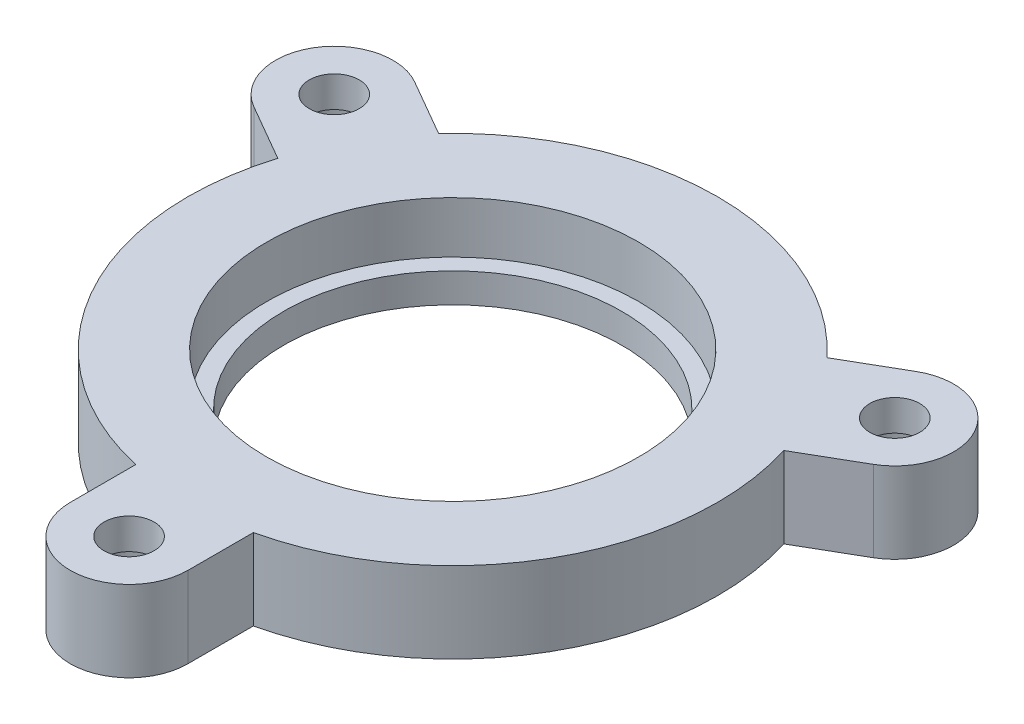
ISO-10303-21;
HEADER;
FILE_DESCRIPTION(('STEP AP214'),'2;1');
FILE_NAME('part.step','',(''),(''),'','','');
FILE_SCHEMA(('AUTOMOTIVE_DESIGN { 1 0 10303 214 1 1 1 1 }'));
ENDSEC;
DATA;
#1=APPLICATION_CONTEXT('core data for automotive mechanical design processes');
#2=APPLICATION_PROTOCOL_DEFINITION('international standard','automotive_design',2000,#1);
#3=PRODUCT_CONTEXT('',#1,'mechanical');
#4=PRODUCT('Part','Part','',(#3));
#5=PRODUCT_RELATED_PRODUCT_CATEGORY('part','',(#4));
#6=PRODUCT_DEFINITION_FORMATION('','',#4);
#7=PRODUCT_DEFINITION_CONTEXT('part definition',#1,'design');
#8=PRODUCT_DEFINITION('design','',#6,#7);
#9=PRODUCT_DEFINITION_SHAPE('','',#8);
#10=(LENGTH_UNIT() NAMED_UNIT(*) SI_UNIT(.MILLI.,.METRE.));
#11=(NAMED_UNIT(*) PLANE_ANGLE_UNIT() SI_UNIT($,.RADIAN.));
#12=(NAMED_UNIT(*) SI_UNIT($,.STERADIAN.) SOLID_ANGLE_UNIT());
#13=UNCERTAINTY_MEASURE_WITH_UNIT(LENGTH_MEASURE(1.E-05),#10,'distance_accuracy_value','');
#14=(GEOMETRIC_REPRESENTATION_CONTEXT(3) GLOBAL_UNCERTAINTY_ASSIGNED_CONTEXT((#13)) GLOBAL_UNIT_ASSIGNED_CONTEXT((#10,
#11,#12)) REPRESENTATION_CONTEXT('',''));
#15=CARTESIAN_POINT('',(0.,0.,0.));
#16=DIRECTION('',(0.,0.,1.));
#17=DIRECTION('',(1.,0.,0.));
#18=AXIS2_PLACEMENT_3D('',#15,#16,#17);
#19=CARTESIAN_POINT('',(0.,5.5,0.));
#20=DIRECTION('',(0.,-1.,0.));
#21=DIRECTION('',(0.,0.,-1.));
#22=AXIS2_PLACEMENT_3D('',#19,#20,#21);
#23=CYLINDRICAL_SURFACE('',#22,11.5);
#24=CARTESIAN_POINT('',(0.,0.,0.));
#25=DIRECTION('',(0.,1.,0.));
#26=DIRECTION('',(0.,0.,1.));
#27=AXIS2_PLACEMENT_3D('',#24,#25,#26);
#28=CIRCLE('',#27,11.5);
#29=CARTESIAN_POINT('',(0.,0.,11.5));
#30=VERTEX_POINT('',#29);
#31=EDGE_CURVE('E217',#30,#30,#28,.T.);
#32=ORIENTED_EDGE('',*,*,#31,.F.);
#33=EDGE_LOOP('',(#32));
#34=FACE_BOUND('',#33,.T.);
#35=CARTESIAN_POINT('',(0.,2.,0.));
#36=DIRECTION('',(0.,1.,0.));
#37=DIRECTION('',(0.,0.,1.));
#38=AXIS2_PLACEMENT_3D('',#35,#36,#37);
#39=CIRCLE('',#38,11.5);
#40=CARTESIAN_POINT('',(0.,2.,11.5));
#41=VERTEX_POINT('',#40);
#42=EDGE_CURVE('E220',#41,#41,#39,.T.);
#43=ORIENTED_EDGE('',*,*,#42,.T.);
#44=EDGE_LOOP('',(#43));
#45=FACE_BOUND('',#44,.T.);
#46=ADVANCED_FACE('F90',(#34,#45),#23,.F.);
#47=CARTESIAN_POINT('',(-4.,5.5,0.));
#48=DIRECTION('',(-1.,0.,0.));
#49=DIRECTION('',(0.,0.,1.));
#50=AXIS2_PLACEMENT_3D('',#47,#48,#49);
#51=PLANE('',#50);
#52=DIRECTION('',(0.,0.,-1.));
#53=VECTOR('',#52,1.);
#54=CARTESIAN_POINT('',(-4.,0.,0.));
#55=LINE('',#54,#53);
#56=CARTESIAN_POINT('',(-4.,0.,22.));
#57=VERTEX_POINT('',#56);
#58=CARTESIAN_POINT('',(-4.,0.,17.5499287747842));
#59=VERTEX_POINT('',#58);
#60=EDGE_CURVE('E272',#57,#59,#55,.T.);
#61=ORIENTED_EDGE('',*,*,#60,.F.);
#62=DIRECTION('',(0.,-1.,0.));
#63=VECTOR('',#62,1.);
#64=CARTESIAN_POINT('',(-4.,5.5,22.));
#65=LINE('',#64,#63);
#66=CARTESIAN_POINT('',(-4.,5.5,22.));
#67=VERTEX_POINT('',#66);
#68=EDGE_CURVE('E100',#67,#57,#65,.T.);
#69=ORIENTED_EDGE('',*,*,#68,.F.);
#70=DIRECTION('',(0.,0.,-1.));
#71=VECTOR('',#70,1.);
#72=CARTESIAN_POINT('',(-4.,5.5,0.));
#73=LINE('',#72,#71);
#74=CARTESIAN_POINT('',(-4.,5.5,17.5499287747842));
#75=VERTEX_POINT('',#74);
#76=EDGE_CURVE('E263',#67,#75,#73,.T.);
#77=ORIENTED_EDGE('',*,*,#76,.T.);
#78=DIRECTION('',(0.,-1.,0.));
#79=VECTOR('',#78,1.);
#80=CARTESIAN_POINT('',(-4.,5.5,17.5499287747842));
#81=LINE('',#80,#79);
#82=EDGE_CURVE('E12',#75,#59,#81,.T.);
#83=ORIENTED_EDGE('',*,*,#82,.T.);
#84=EDGE_LOOP('',(#61,#69,#77,#83));
#85=FACE_BOUND('',#84,.T.);
#86=ADVANCED_FACE('F337',(#85),#51,.T.);
#87=CARTESIAN_POINT('',(0.,5.5,22.));
#88=DIRECTION('',(0.,-1.,0.));
#89=DIRECTION('',(0.,0.,-1.));
#90=AXIS2_PLACEMENT_3D('',#87,#88,#89);
#91=CYLINDRICAL_SURFACE('',#90,4.);
#92=CARTESIAN_POINT('',(0.,0.,22.));
#93=DIRECTION('',(0.,1.,0.));
#94=DIRECTION('',(0.,0.,1.));
#95=AXIS2_PLACEMENT_3D('',#92,#93,#94);
#96=CIRCLE('',#95,4.);
#97=CARTESIAN_POINT('',(4.,0.,22.));
#98=VERTEX_POINT('',#97);
#99=EDGE_CURVE('E274',#57,#98,#96,.T.);
#100=ORIENTED_EDGE('',*,*,#99,.T.);
#101=DIRECTION('',(0.,-1.,0.));
#102=VECTOR('',#101,1.);
#103=CARTESIAN_POINT('',(4.,5.5,22.));
#104=LINE('',#103,#102);
#105=CARTESIAN_POINT('',(4.,5.5,22.));
#106=VERTEX_POINT('',#105);
#107=EDGE_CURVE('E279',#106,#98,#104,.T.);
#108=ORIENTED_EDGE('',*,*,#107,.F.);
#109=CARTESIAN_POINT('',(0.,5.5,22.));
#110=DIRECTION('',(0.,1.,0.));
#111=DIRECTION('',(0.,0.,1.));
#112=AXIS2_PLACEMENT_3D('',#109,#110,#111);
#113=CIRCLE('',#112,4.);
#114=EDGE_CURVE('E266',#67,#106,#113,.T.);
#115=ORIENTED_EDGE('',*,*,#114,.F.);
#116=ORIENTED_EDGE('',*,*,#68,.T.);
#117=EDGE_LOOP('',(#100,#108,#115,#116));
#118=FACE_BOUND('',#117,.T.);
#119=ADVANCED_FACE('F342',(#118),#91,.T.);
#120=CARTESIAN_POINT('',(4.,5.5,0.));
#121=DIRECTION('',(-1.,0.,0.));
#122=DIRECTION('',(0.,0.,1.));
#123=AXIS2_PLACEMENT_3D('',#120,#121,#122);
#124=PLANE('',#123);
#125=DIRECTION('',(0.,0.,-1.));
#126=VECTOR('',#125,1.);
#127=CARTESIAN_POINT('',(4.,0.,0.));
#128=LINE('',#127,#126);
#129=CARTESIAN_POINT('',(4.,0.,17.5499287747842));
#130=VERTEX_POINT('',#129);
#131=EDGE_CURVE('E267',#98,#130,#128,.T.);
#132=ORIENTED_EDGE('',*,*,#131,.T.);
#133=DIRECTION('',(0.,-1.,0.));
#134=VECTOR('',#133,1.);
#135=CARTESIAN_POINT('',(4.,5.5,17.5499287747842));
#136=LINE('',#135,#134);
#137=CARTESIAN_POINT('',(4.,5.5,17.5499287747842));
#138=VERTEX_POINT('',#137);
#139=EDGE_CURVE('E109',#138,#130,#136,.T.);
#140=ORIENTED_EDGE('',*,*,#139,.F.);
#141=DIRECTION('',(0.,0.,-1.));
#142=VECTOR('',#141,1.);
#143=CARTESIAN_POINT('',(4.,5.5,0.));
#144=LINE('',#143,#142);
#145=EDGE_CURVE('E269',#106,#138,#144,.T.);
#146=ORIENTED_EDGE('',*,*,#145,.F.);
#147=ORIENTED_EDGE('',*,*,#107,.T.);
#148=EDGE_LOOP('',(#132,#140,#146,#147));
#149=FACE_BOUND('',#148,.T.);
#150=ADVANCED_FACE('F363',(#149),#124,.F.);
#151=CARTESIAN_POINT('',(0.,0.,0.));
#152=DIRECTION('',(0.,1.,0.));
#153=DIRECTION('',(0.,0.,1.));
#154=AXIS2_PLACEMENT_3D('',#151,#152,#153);
#155=PLANE('',#154);
#156=CARTESIAN_POINT('',(-19.0525588832576,0.,-11.0000000000001));
#157=DIRECTION('',(0.,-1.,0.));
#158=DIRECTION('',(0.,0.,-1.));
#159=AXIS2_PLACEMENT_3D('',#156,#157,#158);
#160=CIRCLE('',#159,3.25);
#161=CARTESIAN_POINT('',(-19.0525588832576,0.,-14.2500000000001));
#162=VERTEX_POINT('',#161);
#163=EDGE_CURVE('E415',#162,#162,#160,.T.);
#164=ORIENTED_EDGE('',*,*,#163,.F.);
#165=EDGE_LOOP('',(#164));
#166=FACE_BOUND('',#165,.T.);
#167=CARTESIAN_POINT('',(19.0525588832577,0.,-10.9999999999998));
#168=DIRECTION('',(0.,-1.,0.));
#169=DIRECTION('',(0.,0.,-1.));
#170=AXIS2_PLACEMENT_3D('',#167,#168,#169);
#171=CIRCLE('',#170,3.25);
#172=CARTESIAN_POINT('',(19.0525588832577,0.,-14.2499999999998));
#173=VERTEX_POINT('',#172);
#174=EDGE_CURVE('E251',#173,#173,#171,.T.);
#175=ORIENTED_EDGE('',*,*,#174,.F.);
#176=EDGE_LOOP('',(#175));
#177=FACE_BOUND('',#176,.T.);
#178=CARTESIAN_POINT('',(0.,0.,22.));
#179=DIRECTION('',(0.,-1.,0.));
#180=DIRECTION('',(0.,0.,-1.));
#181=AXIS2_PLACEMENT_3D('',#178,#179,#180);
#182=CIRCLE('',#181,3.25);
#183=CARTESIAN_POINT('',(0.,0.,18.75));
#184=VERTEX_POINT('',#183);
#185=EDGE_CURVE('E238',#184,#184,#182,.T.);
#186=ORIENTED_EDGE('',*,*,#185,.F.);
#187=EDGE_LOOP('',(#186));
#188=FACE_BOUND('',#187,.T.);
#189=ORIENTED_EDGE('',*,*,#60,.T.);
#190=CARTESIAN_POINT('',(0.,0.,0.));
#191=DIRECTION('',(0.,1.,0.));
#192=DIRECTION('',(0.,0.,1.));
#193=AXIS2_PLACEMENT_3D('',#190,#191,#192);
#194=CIRCLE('',#193,18.);
#195=CARTESIAN_POINT('',(-17.1986841535706,0.,-5.31086277225445));
#196=VERTEX_POINT('',#195);
#197=EDGE_CURVE('E228',#196,#59,#194,.T.);
#198=ORIENTED_EDGE('',*,*,#197,.F.);
#199=DIRECTION('',(0.866025403784436,0.,0.500000000000004));
#200=VECTOR('',#199,1.);
#201=CARTESIAN_POINT('',(-2.00000000000001,0.,3.46410161513774));
#202=LINE('',#201,#200);
#203=CARTESIAN_POINT('',(-21.0525588832576,0.,-7.53589838486234));
#204=VERTEX_POINT('',#203);
#205=EDGE_CURVE('E296',#204,#196,#202,.T.);
#206=ORIENTED_EDGE('',*,*,#205,.F.);
#207=CARTESIAN_POINT('',(-19.0525588832576,0.,-11.0000000000001));
#208=DIRECTION('',(0.,1.,0.));
#209=DIRECTION('',(0.,0.,1.));
#210=AXIS2_PLACEMENT_3D('',#207,#208,#209);
#211=CIRCLE('',#210,4.);
#212=CARTESIAN_POINT('',(-17.0525588832576,0.,-14.4641016151378));
#213=VERTEX_POINT('',#212);
#214=EDGE_CURVE('E216',#213,#204,#211,.T.);
#215=ORIENTED_EDGE('',*,*,#214,.F.);
#216=DIRECTION('',(0.866025403784436,0.,0.500000000000004));
#217=VECTOR('',#216,1.);
#218=CARTESIAN_POINT('',(2.00000000000002,0.,-3.46410161513775));
#219=LINE('',#218,#217);
#220=CARTESIAN_POINT('',(-13.1986841535706,0.,-12.2390660025299));
#221=VERTEX_POINT('',#220);
#222=EDGE_CURVE('E287',#213,#221,#219,.T.);
#223=ORIENTED_EDGE('',*,*,#222,.T.);
#224=CARTESIAN_POINT('',(13.1986841535708,0.,-12.2390660025298));
#225=VERTEX_POINT('',#224);
#226=EDGE_CURVE('E225',#225,#221,#194,.T.);
#227=ORIENTED_EDGE('',*,*,#226,.F.);
#228=DIRECTION('',(-0.866025403784443,0.,0.499999999999992));
#229=VECTOR('',#228,1.);
#230=CARTESIAN_POINT('',(-1.99999999999997,0.,-3.46410161513777));
#231=LINE('',#230,#229);
#232=CARTESIAN_POINT('',(17.0525588832578,0.,-14.4641016151376));
#233=VERTEX_POINT('',#232);
#234=EDGE_CURVE('E201',#233,#225,#231,.T.);
#235=ORIENTED_EDGE('',*,*,#234,.F.);
#236=CARTESIAN_POINT('',(19.0525588832577,0.,-10.9999999999998));
#237=DIRECTION('',(0.,1.,0.));
#238=DIRECTION('',(0.,0.,1.));
#239=AXIS2_PLACEMENT_3D('',#236,#237,#238);
#240=CIRCLE('',#239,4.);
#241=CARTESIAN_POINT('',(21.0525588832577,0.,-7.53589838486205));
#242=VERTEX_POINT('',#241);
#243=EDGE_CURVE('E183',#242,#233,#240,.T.);
#244=ORIENTED_EDGE('',*,*,#243,.F.);
#245=DIRECTION('',(-0.866025403784443,0.,0.499999999999992));
#246=VECTOR('',#245,1.);
#247=CARTESIAN_POINT('',(1.99999999999997,0.,3.46410161513777));
#248=LINE('',#247,#246);
#249=CARTESIAN_POINT('',(17.1986841535707,0.,-5.31086277225421));
#250=VERTEX_POINT('',#249);
#251=EDGE_CURVE('E198',#242,#250,#248,.T.);
#252=ORIENTED_EDGE('',*,*,#251,.T.);
#253=EDGE_CURVE('E173',#130,#250,#194,.T.);
#254=ORIENTED_EDGE('',*,*,#253,.F.);
#255=ORIENTED_EDGE('',*,*,#131,.F.);
#256=ORIENTED_EDGE('',*,*,#99,.F.);
#257=EDGE_LOOP('',(#189,#198,#206,#215,#223,#227,#235,#244,#252,#254,#255,#256));
#258=FACE_BOUND('',#257,.T.);
#259=ORIENTED_EDGE('',*,*,#31,.T.);
#260=EDGE_LOOP('',(#259));
#261=FACE_BOUND('',#260,.T.);
#262=ADVANCED_FACE('F196',(#166,#177,#188,#258,#261),#155,.F.);
#263=CARTESIAN_POINT('',(0.,5.5,0.));
#264=DIRECTION('',(0.,1.,0.));
#265=DIRECTION('',(0.,0.,1.));
#266=AXIS2_PLACEMENT_3D('',#263,#264,#265);
#267=PLANE('',#266);
#268=CARTESIAN_POINT('',(-19.0525588832576,5.5,-11.0000000000001));
#269=DIRECTION('',(0.,1.,0.));
#270=DIRECTION('',(0.,0.,1.));
#271=AXIS2_PLACEMENT_3D('',#268,#269,#270);
#272=CIRCLE('',#271,1.69999999999999);
#273=CARTESIAN_POINT('',(-19.0525588832576,5.5,-9.30000000000009));
#274=VERTEX_POINT('',#273);
#275=EDGE_CURVE('E94',#274,#274,#272,.T.);
#276=ORIENTED_EDGE('',*,*,#275,.F.);
#277=EDGE_LOOP('',(#276));
#278=FACE_BOUND('',#277,.T.);
#279=CARTESIAN_POINT('',(19.0525588832577,5.5,-10.9999999999998));
#280=DIRECTION('',(0.,1.,0.));
#281=DIRECTION('',(0.,0.,1.));
#282=AXIS2_PLACEMENT_3D('',#279,#280,#281);
#283=CIRCLE('',#282,1.69999999999999);
#284=CARTESIAN_POINT('',(19.0525588832577,5.5,-9.29999999999983));
#285=VERTEX_POINT('',#284);
#286=EDGE_CURVE('E236',#285,#285,#283,.T.);
#287=ORIENTED_EDGE('',*,*,#286,.F.);
#288=EDGE_LOOP('',(#287));
#289=FACE_BOUND('',#288,.T.);
#290=CARTESIAN_POINT('',(0.,5.5,22.));
#291=DIRECTION('',(0.,1.,0.));
#292=DIRECTION('',(0.,0.,1.));
#293=AXIS2_PLACEMENT_3D('',#290,#291,#292);
#294=CIRCLE('',#293,1.69999999999999);
#295=CARTESIAN_POINT('',(0.,5.5,23.7));
#296=VERTEX_POINT('',#295);
#297=EDGE_CURVE('E232',#296,#296,#294,.T.);
#298=ORIENTED_EDGE('',*,*,#297,.F.);
#299=EDGE_LOOP('',(#298));
#300=FACE_BOUND('',#299,.T.);
#301=CARTESIAN_POINT('',(0.,5.5,0.));
#302=DIRECTION('',(0.,1.,0.));
#303=DIRECTION('',(0.,0.,1.));
#304=AXIS2_PLACEMENT_3D('',#301,#302,#303);
#305=CIRCLE('',#304,12.65);
#306=CARTESIAN_POINT('',(0.,5.5,12.65));
#307=VERTEX_POINT('',#306);
#308=EDGE_CURVE('E234',#307,#307,#305,.T.);
#309=ORIENTED_EDGE('',*,*,#308,.F.);
#310=EDGE_LOOP('',(#309));
#311=FACE_BOUND('',#310,.T.);
#312=ORIENTED_EDGE('',*,*,#145,.T.);
#313=CARTESIAN_POINT('',(0.,5.5,0.));
#314=DIRECTION('',(0.,1.,0.));
#315=DIRECTION('',(0.,0.,1.));
#316=AXIS2_PLACEMENT_3D('',#313,#314,#315);
#317=CIRCLE('',#316,18.);
#318=CARTESIAN_POINT('',(17.1986841535707,5.5,-5.31086277225421));
#319=VERTEX_POINT('',#318);
#320=EDGE_CURVE('E224',#138,#319,#317,.T.);
#321=ORIENTED_EDGE('',*,*,#320,.T.);
#322=DIRECTION('',(-0.866025403784443,0.,0.499999999999992));
#323=VECTOR('',#322,1.);
#324=CARTESIAN_POINT('',(1.99999999999997,5.5,3.46410161513777));
#325=LINE('',#324,#323);
#326=CARTESIAN_POINT('',(21.0525588832577,5.5,-7.53589838486205));
#327=VERTEX_POINT('',#326);
#328=EDGE_CURVE('E191',#327,#319,#325,.T.);
#329=ORIENTED_EDGE('',*,*,#328,.F.);
#330=CARTESIAN_POINT('',(19.0525588832577,5.5,-10.9999999999998));
#331=DIRECTION('',(0.,1.,0.));
#332=DIRECTION('',(0.,0.,1.));
#333=AXIS2_PLACEMENT_3D('',#330,#331,#332);
#334=CIRCLE('',#333,4.);
#335=CARTESIAN_POINT('',(17.0525588832578,5.5,-14.4641016151376));
#336=VERTEX_POINT('',#335);
#337=EDGE_CURVE('E185',#327,#336,#334,.T.);
#338=ORIENTED_EDGE('',*,*,#337,.T.);
#339=DIRECTION('',(-0.866025403784443,0.,0.499999999999992));
#340=VECTOR('',#339,1.);
#341=CARTESIAN_POINT('',(-1.99999999999997,5.5,-3.46410161513777));
#342=LINE('',#341,#340);
#343=CARTESIAN_POINT('',(13.1986841535708,5.5,-12.2390660025298));
#344=VERTEX_POINT('',#343);
#345=EDGE_CURVE('E207',#336,#344,#342,.T.);
#346=ORIENTED_EDGE('',*,*,#345,.T.);
#347=CARTESIAN_POINT('',(-13.1986841535706,5.5,-12.2390660025299));
#348=VERTEX_POINT('',#347);
#349=EDGE_CURVE('E203',#344,#348,#317,.T.);
#350=ORIENTED_EDGE('',*,*,#349,.T.);
#351=DIRECTION('',(0.866025403784436,0.,0.500000000000004));
#352=VECTOR('',#351,1.);
#353=CARTESIAN_POINT('',(2.00000000000002,5.5,-3.46410161513775));
#354=LINE('',#353,#352);
#355=CARTESIAN_POINT('',(-17.0525588832576,5.5,-14.4641016151378));
#356=VERTEX_POINT('',#355);
#357=EDGE_CURVE('E290',#356,#348,#354,.T.);
#358=ORIENTED_EDGE('',*,*,#357,.F.);
#359=CARTESIAN_POINT('',(-19.0525588832576,5.5,-11.0000000000001));
#360=DIRECTION('',(0.,1.,0.));
#361=DIRECTION('',(0.,0.,1.));
#362=AXIS2_PLACEMENT_3D('',#359,#360,#361);
#363=CIRCLE('',#362,4.);
#364=CARTESIAN_POINT('',(-21.0525588832576,5.5,-7.53589838486234));
#365=VERTEX_POINT('',#364);
#366=EDGE_CURVE('E283',#356,#365,#363,.T.);
#367=ORIENTED_EDGE('',*,*,#366,.T.);
#368=DIRECTION('',(0.866025403784436,0.,0.500000000000004));
#369=VECTOR('',#368,1.);
#370=CARTESIAN_POINT('',(-2.00000000000001,5.5,3.46410161513774));
#371=LINE('',#370,#369);
#372=CARTESIAN_POINT('',(-17.1986841535706,5.5,-5.31086277225445));
#373=VERTEX_POINT('',#372);
#374=EDGE_CURVE('E286',#365,#373,#371,.T.);
#375=ORIENTED_EDGE('',*,*,#374,.T.);
#376=EDGE_CURVE('E223',#373,#75,#317,.T.);
#377=ORIENTED_EDGE('',*,*,#376,.T.);
#378=ORIENTED_EDGE('',*,*,#76,.F.);
#379=ORIENTED_EDGE('',*,*,#114,.T.);
#380=EDGE_LOOP('',(#312,#321,#329,#338,#346,#350,#358,#367,#375,#377,#378,#379));
#381=FACE_BOUND('',#380,.T.);
#382=ADVANCED_FACE('F311',(#278,#289,#300,#311,#381),#267,.T.);
#383=CARTESIAN_POINT('',(2.00000000000002,5.5,-3.46410161513775));
#384=DIRECTION('',(0.500000000000004,0.,-0.866025403784437));
#385=DIRECTION('',(-0.866025403784437,0.,-0.500000000000004));
#386=AXIS2_PLACEMENT_3D('',#383,#384,#385);
#387=PLANE('',#386);
#388=ORIENTED_EDGE('',*,*,#222,.F.);
#389=DIRECTION('',(0.,-1.,0.));
#390=VECTOR('',#389,1.);
#391=CARTESIAN_POINT('',(-17.0525588832576,5.5,-14.4641016151378));
#392=LINE('',#391,#390);
#393=EDGE_CURVE('E293',#356,#213,#392,.T.);
#394=ORIENTED_EDGE('',*,*,#393,.F.);
#395=ORIENTED_EDGE('',*,*,#357,.T.);
#396=DIRECTION('',(0.,-1.,0.));
#397=VECTOR('',#396,1.);
#398=CARTESIAN_POINT('',(-13.1986841535706,5.5,-12.2390660025299));
#399=LINE('',#398,#397);
#400=EDGE_CURVE('E302',#348,#221,#399,.T.);
#401=ORIENTED_EDGE('',*,*,#400,.T.);
#402=EDGE_LOOP('',(#388,#394,#395,#401));
#403=FACE_BOUND('',#402,.T.);
#404=ADVANCED_FACE('F332',(#403),#387,.T.);
#405=CARTESIAN_POINT('',(-19.0525588832576,5.5,-11.0000000000001));
#406=DIRECTION('',(0.,-1.,0.));
#407=DIRECTION('',(0.,0.,-1.));
#408=AXIS2_PLACEMENT_3D('',#405,#406,#407);
#409=CYLINDRICAL_SURFACE('',#408,4.);
#410=ORIENTED_EDGE('',*,*,#214,.T.);
#411=DIRECTION('',(0.,-1.,0.));
#412=VECTOR('',#411,1.);
#413=CARTESIAN_POINT('',(-21.0525588832576,5.5,-7.53589838486234));
#414=LINE('',#413,#412);
#415=EDGE_CURVE('E275',#365,#204,#414,.T.);
#416=ORIENTED_EDGE('',*,*,#415,.F.);
#417=ORIENTED_EDGE('',*,*,#366,.F.);
#418=ORIENTED_EDGE('',*,*,#393,.T.);
#419=EDGE_LOOP('',(#410,#416,#417,#418));
#420=FACE_BOUND('',#419,.T.);
#421=ADVANCED_FACE('F326',(#420),#409,.T.);
#422=CARTESIAN_POINT('',(-1.99999999999997,5.5,-3.46410161513777));
#423=DIRECTION('',(0.499999999999992,0.,0.866025403784443));
#424=DIRECTION('',(0.866025403784443,0.,-0.499999999999992));
#425=AXIS2_PLACEMENT_3D('',#422,#423,#424);
#426=PLANE('',#425);
#427=ORIENTED_EDGE('',*,*,#234,.T.);
#428=DIRECTION('',(0.,-1.,0.));
#429=VECTOR('',#428,1.);
#430=CARTESIAN_POINT('',(13.1986841535708,5.5,-12.2390660025298));
#431=LINE('',#430,#429);
#432=EDGE_CURVE('E212',#344,#225,#431,.T.);
#433=ORIENTED_EDGE('',*,*,#432,.F.);
#434=ORIENTED_EDGE('',*,*,#345,.F.);
#435=DIRECTION('',(0.,-1.,0.));
#436=VECTOR('',#435,1.);
#437=CARTESIAN_POINT('',(17.0525588832578,5.5,-14.4641016151376));
#438=LINE('',#437,#436);
#439=EDGE_CURVE('E214',#336,#233,#438,.T.);
#440=ORIENTED_EDGE('',*,*,#439,.T.);
#441=EDGE_LOOP('',(#427,#433,#434,#440));
#442=FACE_BOUND('',#441,.T.);
#443=ADVANCED_FACE('F325',(#442),#426,.F.);
#444=CARTESIAN_POINT('',(19.0525588832577,5.5,-10.9999999999998));
#445=DIRECTION('',(0.,-1.,0.));
#446=DIRECTION('',(0.,0.,-1.));
#447=AXIS2_PLACEMENT_3D('',#444,#445,#446);
#448=CYLINDRICAL_SURFACE('',#447,4.);
#449=ORIENTED_EDGE('',*,*,#243,.T.);
#450=ORIENTED_EDGE('',*,*,#439,.F.);
#451=ORIENTED_EDGE('',*,*,#337,.F.);
#452=DIRECTION('',(0.,-1.,0.));
#453=VECTOR('',#452,1.);
#454=CARTESIAN_POINT('',(21.0525588832577,5.5,-7.53589838486205));
#455=LINE('',#454,#453);
#456=EDGE_CURVE('E179',#327,#242,#455,.T.);
#457=ORIENTED_EDGE('',*,*,#456,.T.);
#458=EDGE_LOOP('',(#449,#450,#451,#457));
#459=FACE_BOUND('',#458,.T.);
#460=ADVANCED_FACE('F181',(#459),#448,.T.);
#461=CARTESIAN_POINT('',(-2.00000000000001,5.5,3.46410161513774));
#462=DIRECTION('',(0.500000000000004,0.,-0.866025403784437));
#463=DIRECTION('',(-0.866025403784437,0.,-0.500000000000004));
#464=AXIS2_PLACEMENT_3D('',#461,#462,#463);
#465=PLANE('',#464);
#466=ORIENTED_EDGE('',*,*,#205,.T.);
#467=DIRECTION('',(0.,-1.,0.));
#468=VECTOR('',#467,1.);
#469=CARTESIAN_POINT('',(-17.1986841535706,5.5,-5.31086277225445));
#470=LINE('',#469,#468);
#471=EDGE_CURVE('E304',#373,#196,#470,.T.);
#472=ORIENTED_EDGE('',*,*,#471,.F.);
#473=ORIENTED_EDGE('',*,*,#374,.F.);
#474=ORIENTED_EDGE('',*,*,#415,.T.);
#475=EDGE_LOOP('',(#466,#472,#473,#474));
#476=FACE_BOUND('',#475,.T.);
#477=ADVANCED_FACE('F316',(#476),#465,.F.);
#478=CARTESIAN_POINT('',(1.99999999999997,5.5,3.46410161513777));
#479=DIRECTION('',(0.499999999999992,0.,0.866025403784443));
#480=DIRECTION('',(0.866025403784443,0.,-0.499999999999992));
#481=AXIS2_PLACEMENT_3D('',#478,#479,#480);
#482=PLANE('',#481);
#483=ORIENTED_EDGE('',*,*,#251,.F.);
#484=ORIENTED_EDGE('',*,*,#456,.F.);
#485=ORIENTED_EDGE('',*,*,#328,.T.);
#486=DIRECTION('',(0.,-1.,0.));
#487=VECTOR('',#486,1.);
#488=CARTESIAN_POINT('',(17.1986841535707,5.5,-5.31086277225421));
#489=LINE('',#488,#487);
#490=EDGE_CURVE('E190',#319,#250,#489,.T.);
#491=ORIENTED_EDGE('',*,*,#490,.T.);
#492=EDGE_LOOP('',(#483,#484,#485,#491));
#493=FACE_BOUND('',#492,.T.);
#494=ADVANCED_FACE('F205',(#493),#482,.T.);
#495=CARTESIAN_POINT('',(0.,5.5,0.));
#496=DIRECTION('',(0.,-1.,0.));
#497=DIRECTION('',(0.,0.,-1.));
#498=AXIS2_PLACEMENT_3D('',#495,#496,#497);
#499=CYLINDRICAL_SURFACE('',#498,18.);
#500=ORIENTED_EDGE('',*,*,#400,.F.);
#501=ORIENTED_EDGE('',*,*,#349,.F.);
#502=ORIENTED_EDGE('',*,*,#432,.T.);
#503=ORIENTED_EDGE('',*,*,#226,.T.);
#504=EDGE_LOOP('',(#500,#501,#502,#503));
#505=FACE_BOUND('',#504,.T.);
#506=ADVANCED_FACE('F92',(#505),#499,.T.);
#507=ORIENTED_EDGE('',*,*,#82,.F.);
#508=ORIENTED_EDGE('',*,*,#376,.F.);
#509=ORIENTED_EDGE('',*,*,#471,.T.);
#510=ORIENTED_EDGE('',*,*,#197,.T.);
#511=EDGE_LOOP('',(#507,#508,#509,#510));
#512=FACE_BOUND('',#511,.T.);
#513=ADVANCED_FACE('F315',(#512),#499,.T.);
#514=ORIENTED_EDGE('',*,*,#320,.F.);
#515=ORIENTED_EDGE('',*,*,#139,.T.);
#516=ORIENTED_EDGE('',*,*,#253,.T.);
#517=ORIENTED_EDGE('',*,*,#490,.F.);
#518=EDGE_LOOP('',(#514,#515,#516,#517));
#519=FACE_BOUND('',#518,.T.);
#520=ADVANCED_FACE('F312',(#519),#499,.T.);
#521=CARTESIAN_POINT('',(0.,2.,0.));
#522=DIRECTION('',(0.,1.,0.));
#523=DIRECTION('',(0.,0.,1.));
#524=AXIS2_PLACEMENT_3D('',#521,#522,#523);
#525=CYLINDRICAL_SURFACE('',#524,12.65);
#526=CARTESIAN_POINT('',(0.,2.,0.));
#527=DIRECTION('',(0.,1.,0.));
#528=DIRECTION('',(0.,0.,1.));
#529=AXIS2_PLACEMENT_3D('',#526,#527,#528);
#530=CIRCLE('',#529,12.65);
#531=CARTESIAN_POINT('',(0.,2.,12.65));
#532=VERTEX_POINT('',#531);
#533=EDGE_CURVE('E231',#532,#532,#530,.T.);
#534=ORIENTED_EDGE('',*,*,#533,.F.);
#535=EDGE_LOOP('',(#534));
#536=FACE_BOUND('',#535,.T.);
#537=ORIENTED_EDGE('',*,*,#308,.T.);
#538=EDGE_LOOP('',(#537));
#539=FACE_BOUND('',#538,.T.);
#540=ADVANCED_FACE('F314',(#536,#539),#525,.F.);
#541=CARTESIAN_POINT('',(0.,2.,0.));
#542=DIRECTION('',(0.,1.,0.));
#543=DIRECTION('',(0.,0.,1.));
#544=AXIS2_PLACEMENT_3D('',#541,#542,#543);
#545=PLANE('',#544);
#546=ORIENTED_EDGE('',*,*,#42,.F.);
#547=EDGE_LOOP('',(#546));
#548=FACE_BOUND('',#547,.T.);
#549=ORIENTED_EDGE('',*,*,#533,.T.);
#550=EDGE_LOOP('',(#549));
#551=FACE_BOUND('',#550,.T.);
#552=ADVANCED_FACE('F321',(#548,#551),#545,.T.);
#553=CARTESIAN_POINT('',(0.,0.,22.));
#554=DIRECTION('',(0.,-1.,0.));
#555=DIRECTION('',(0.,0.,-1.));
#556=AXIS2_PLACEMENT_3D('',#553,#554,#555);
#557=CYLINDRICAL_SURFACE('',#556,1.69999999999999);
#558=ORIENTED_EDGE('',*,*,#297,.T.);
#559=EDGE_LOOP('',(#558));
#560=FACE_BOUND('',#559,.T.);
#561=CARTESIAN_POINT('',(0.,3.4,22.));
#562=DIRECTION('',(0.,-1.,0.));
#563=DIRECTION('',(0.,0.,-1.));
#564=AXIS2_PLACEMENT_3D('',#561,#562,#563);
#565=CIRCLE('',#564,1.7);
#566=CARTESIAN_POINT('',(0.,3.4,20.3));
#567=VERTEX_POINT('',#566);
#568=EDGE_CURVE('E235',#567,#567,#565,.T.);
#569=ORIENTED_EDGE('',*,*,#568,.T.);
#570=EDGE_LOOP('',(#569));
#571=FACE_BOUND('',#570,.T.);
#572=ADVANCED_FACE('F372',(#560,#571),#557,.F.);
#573=CARTESIAN_POINT('',(1.7,3.4,22.));
#574=DIRECTION('',(0.,1.,0.));
#575=DIRECTION('',(0.,0.,1.));
#576=AXIS2_PLACEMENT_3D('',#573,#574,#575);
#577=PLANE('',#576);
#578=ORIENTED_EDGE('',*,*,#568,.F.);
#579=EDGE_LOOP('',(#578));
#580=FACE_BOUND('',#579,.T.);
#581=CARTESIAN_POINT('',(0.,3.4,22.));
#582=DIRECTION('',(0.,-1.,0.));
#583=DIRECTION('',(0.,0.,-1.));
#584=AXIS2_PLACEMENT_3D('',#581,#582,#583);
#585=CIRCLE('',#584,3.25);
#586=CARTESIAN_POINT('',(0.,3.4,18.75));
#587=VERTEX_POINT('',#586);
#588=EDGE_CURVE('E243',#587,#587,#585,.T.);
#589=ORIENTED_EDGE('',*,*,#588,.T.);
#590=EDGE_LOOP('',(#589));
#591=FACE_BOUND('',#590,.T.);
#592=ADVANCED_FACE('F376',(#580,#591),#577,.F.);
#593=CARTESIAN_POINT('',(0.,0.,22.));
#594=DIRECTION('',(0.,-1.,0.));
#595=DIRECTION('',(0.,0.,-1.));
#596=AXIS2_PLACEMENT_3D('',#593,#594,#595);
#597=CYLINDRICAL_SURFACE('',#596,3.25);
#598=ORIENTED_EDGE('',*,*,#588,.F.);
#599=EDGE_LOOP('',(#598));
#600=FACE_BOUND('',#599,.T.);
#601=ORIENTED_EDGE('',*,*,#185,.T.);
#602=EDGE_LOOP('',(#601));
#603=FACE_BOUND('',#602,.T.);
#604=ADVANCED_FACE('F380',(#600,#603),#597,.F.);
#605=CARTESIAN_POINT('',(19.0525588832577,0.,-10.9999999999998));
#606=DIRECTION('',(0.,-1.,0.));
#607=DIRECTION('',(0.,0.,-1.));
#608=AXIS2_PLACEMENT_3D('',#605,#606,#607);
#609=CYLINDRICAL_SURFACE('',#608,1.69999999999999);
#610=ORIENTED_EDGE('',*,*,#286,.T.);
#611=EDGE_LOOP('',(#610));
#612=FACE_BOUND('',#611,.T.);
#613=CARTESIAN_POINT('',(19.0525588832577,3.4,-10.9999999999998));
#614=DIRECTION('',(0.,-1.,0.));
#615=DIRECTION('',(0.,0.,-1.));
#616=AXIS2_PLACEMENT_3D('',#613,#614,#615);
#617=CIRCLE('',#616,1.7);
#618=CARTESIAN_POINT('',(19.0525588832577,3.4,-12.6999999999998));
#619=VERTEX_POINT('',#618);
#620=EDGE_CURVE('E239',#619,#619,#617,.T.);
#621=ORIENTED_EDGE('',*,*,#620,.T.);
#622=EDGE_LOOP('',(#621));
#623=FACE_BOUND('',#622,.T.);
#624=ADVANCED_FACE('F384',(#612,#623),#609,.F.);
#625=CARTESIAN_POINT('',(20.7525588832577,3.4,-10.9999999999998));
#626=DIRECTION('',(0.,1.,0.));
#627=DIRECTION('',(0.,0.,1.));
#628=AXIS2_PLACEMENT_3D('',#625,#626,#627);
#629=PLANE('',#628);
#630=ORIENTED_EDGE('',*,*,#620,.F.);
#631=EDGE_LOOP('',(#630));
#632=FACE_BOUND('',#631,.T.);
#633=CARTESIAN_POINT('',(19.0525588832577,3.4,-10.9999999999998));
#634=DIRECTION('',(0.,-1.,0.));
#635=DIRECTION('',(0.,0.,-1.));
#636=AXIS2_PLACEMENT_3D('',#633,#634,#635);
#637=CIRCLE('',#636,3.25);
#638=CARTESIAN_POINT('',(19.0525588832577,3.4,-14.2499999999998));
#639=VERTEX_POINT('',#638);
#640=EDGE_CURVE('E246',#639,#639,#637,.T.);
#641=ORIENTED_EDGE('',*,*,#640,.T.);
#642=EDGE_LOOP('',(#641));
#643=FACE_BOUND('',#642,.T.);
#644=ADVANCED_FACE('F388',(#632,#643),#629,.F.);
#645=CARTESIAN_POINT('',(19.0525588832577,0.,-10.9999999999998));
#646=DIRECTION('',(0.,-1.,0.));
#647=DIRECTION('',(0.,0.,-1.));
#648=AXIS2_PLACEMENT_3D('',#645,#646,#647);
#649=CYLINDRICAL_SURFACE('',#648,3.25);
#650=ORIENTED_EDGE('',*,*,#640,.F.);
#651=EDGE_LOOP('',(#650));
#652=FACE_BOUND('',#651,.T.);
#653=ORIENTED_EDGE('',*,*,#174,.T.);
#654=EDGE_LOOP('',(#653));
#655=FACE_BOUND('',#654,.T.);
#656=ADVANCED_FACE('F391',(#652,#655),#649,.F.);
#657=CARTESIAN_POINT('',(-19.0525588832576,0.,-11.0000000000001));
#658=DIRECTION('',(0.,-1.,0.));
#659=DIRECTION('',(0.,0.,-1.));
#660=AXIS2_PLACEMENT_3D('',#657,#658,#659);
#661=CYLINDRICAL_SURFACE('',#660,1.69999999999999);
#662=ORIENTED_EDGE('',*,*,#275,.T.);
#663=EDGE_LOOP('',(#662));
#664=FACE_BOUND('',#663,.T.);
#665=CARTESIAN_POINT('',(-19.0525588832576,3.4,-11.0000000000001));
#666=DIRECTION('',(0.,-1.,0.));
#667=DIRECTION('',(0.,0.,-1.));
#668=AXIS2_PLACEMENT_3D('',#665,#666,#667);
#669=CIRCLE('',#668,1.7);
#670=CARTESIAN_POINT('',(-19.0525588832576,3.4,-12.7000000000001));
#671=VERTEX_POINT('',#670);
#672=EDGE_CURVE('E417',#671,#671,#669,.T.);
#673=ORIENTED_EDGE('',*,*,#672,.T.);
#674=EDGE_LOOP('',(#673));
#675=FACE_BOUND('',#674,.T.);
#676=ADVANCED_FACE('F395',(#664,#675),#661,.F.);
#677=CARTESIAN_POINT('',(-17.3525588832576,3.4,-11.0000000000001));
#678=DIRECTION('',(0.,1.,0.));
#679=DIRECTION('',(0.,0.,1.));
#680=AXIS2_PLACEMENT_3D('',#677,#678,#679);
#681=PLANE('',#680);
#682=ORIENTED_EDGE('',*,*,#672,.F.);
#683=EDGE_LOOP('',(#682));
#684=FACE_BOUND('',#683,.T.);
#685=CARTESIAN_POINT('',(-19.0525588832576,3.4,-11.0000000000001));
#686=DIRECTION('',(0.,-1.,0.));
#687=DIRECTION('',(0.,0.,-1.));
#688=AXIS2_PLACEMENT_3D('',#685,#686,#687);
#689=CIRCLE('',#688,3.25);
#690=CARTESIAN_POINT('',(-19.0525588832576,3.4,-14.2500000000001));
#691=VERTEX_POINT('',#690);
#692=EDGE_CURVE('E412',#691,#691,#689,.T.);
#693=ORIENTED_EDGE('',*,*,#692,.T.);
#694=EDGE_LOOP('',(#693));
#695=FACE_BOUND('',#694,.T.);
#696=ADVANCED_FACE('F399',(#684,#695),#681,.F.);
#697=CARTESIAN_POINT('',(-19.0525588832576,0.,-11.0000000000001));
#698=DIRECTION('',(0.,-1.,0.));
#699=DIRECTION('',(0.,0.,-1.));
#700=AXIS2_PLACEMENT_3D('',#697,#698,#699);
#701=CYLINDRICAL_SURFACE('',#700,3.25);
#702=ORIENTED_EDGE('',*,*,#692,.F.);
#703=EDGE_LOOP('',(#702));
#704=FACE_BOUND('',#703,.T.);
#705=ORIENTED_EDGE('',*,*,#163,.T.);
#706=EDGE_LOOP('',(#705));
#707=FACE_BOUND('',#706,.T.);
#708=ADVANCED_FACE('F403',(#704,#707),#701,.F.);
#709=CLOSED_SHELL('',(#46,#86,#119,#150,#262,#382,#404,#421,#443,#460,#477,#494,#506,#513,#520,
#540,#552,#572,#592,#604,#624,#644,#656,#676,#696,#708));
#710=MANIFOLD_SOLID_BREP('B2',#709);
#711=ADVANCED_BREP_SHAPE_REPRESENTATION('',(#18,#710),#14);
#712=SHAPE_DEFINITION_REPRESENTATION(#9,#711);
ENDSEC;
END-ISO-10303-21;
